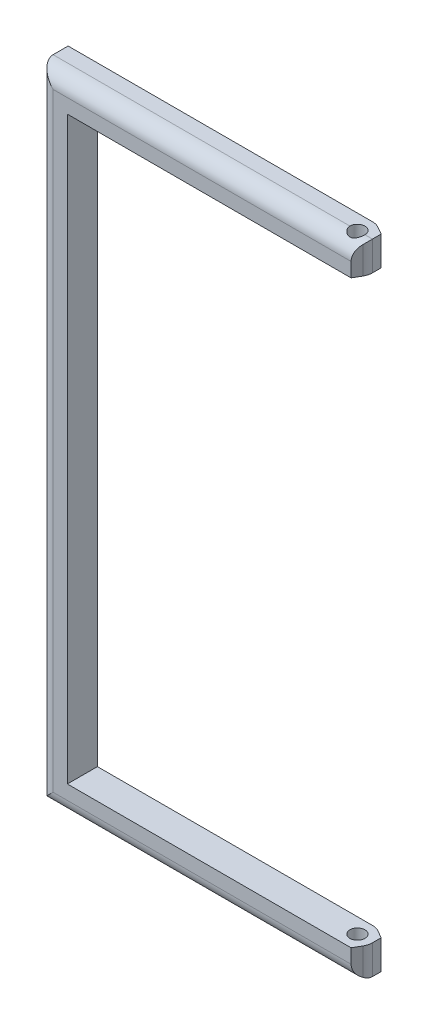
ISO-10303-21;
HEADER;
FILE_DESCRIPTION(('STEP AP214'),'2;1');
FILE_NAME('part.step','',(''),(''),'','','');
FILE_SCHEMA(('AUTOMOTIVE_DESIGN { 1 0 10303 214 1 1 1 1 }'));
ENDSEC;
DATA;
#1=APPLICATION_CONTEXT('core data for automotive mechanical design processes');
#2=APPLICATION_PROTOCOL_DEFINITION('international standard','automotive_design',2000,#1);
#3=PRODUCT_CONTEXT('',#1,'mechanical');
#4=PRODUCT('Part','Part','',(#3));
#5=PRODUCT_RELATED_PRODUCT_CATEGORY('part','',(#4));
#6=PRODUCT_DEFINITION_FORMATION('','',#4);
#7=PRODUCT_DEFINITION_CONTEXT('part definition',#1,'design');
#8=PRODUCT_DEFINITION('design','',#6,#7);
#9=PRODUCT_DEFINITION_SHAPE('','',#8);
#10=(LENGTH_UNIT() NAMED_UNIT(*) SI_UNIT(.MILLI.,.METRE.));
#11=(NAMED_UNIT(*) PLANE_ANGLE_UNIT() SI_UNIT($,.RADIAN.));
#12=(NAMED_UNIT(*) SI_UNIT($,.STERADIAN.) SOLID_ANGLE_UNIT());
#13=UNCERTAINTY_MEASURE_WITH_UNIT(LENGTH_MEASURE(1.E-05),#10,'distance_accuracy_value','');
#14=(GEOMETRIC_REPRESENTATION_CONTEXT(3) GLOBAL_UNCERTAINTY_ASSIGNED_CONTEXT((#13)) GLOBAL_UNIT_ASSIGNED_CONTEXT((#10,
#11,#12)) REPRESENTATION_CONTEXT('',''));
#15=CARTESIAN_POINT('',(0.,0.,0.));
#16=DIRECTION('',(0.,0.,1.));
#17=DIRECTION('',(1.,0.,0.));
#18=AXIS2_PLACEMENT_3D('',#15,#16,#17);
#19=CARTESIAN_POINT('',(136.299385308343,12.1580789864667,-4.));
#20=DIRECTION('',(1.,0.,0.));
#21=DIRECTION('',(0.,0.,-1.));
#22=AXIS2_PLACEMENT_3D('',#19,#20,#21);
#23=PLANE('',#22);
#24=DIRECTION('',(0.,1.,0.));
#25=VECTOR('',#24,1.);
#26=CARTESIAN_POINT('',(136.299385308343,-68.9419210135332,-3.1547005383791));
#27=LINE('',#26,#25);
#28=CARTESIAN_POINT('',(136.299385308343,12.1580789864667,-3.1547005383791));
#29=VERTEX_POINT('',#28);
#30=CARTESIAN_POINT('',(136.299385308343,16.0580789864667,-3.1547005383791));
#31=VERTEX_POINT('',#30);
#32=EDGE_CURVE('E179',#29,#31,#27,.T.);
#33=ORIENTED_EDGE('',*,*,#32,.T.);
#34=DIRECTION('',(0.,0.,1.));
#35=VECTOR('',#34,1.);
#36=CARTESIAN_POINT('',(136.299385308343,16.0580789864667,-4.));
#37=LINE('',#36,#35);
#38=CARTESIAN_POINT('',(136.299385308343,16.0580789864667,-2.));
#39=VERTEX_POINT('',#38);
#40=EDGE_CURVE('E317',#31,#39,#37,.T.);
#41=ORIENTED_EDGE('',*,*,#40,.T.);
#42=DIRECTION('',(0.,1.,0.));
#43=VECTOR('',#42,1.);
#44=CARTESIAN_POINT('',(136.299385308343,-68.9419210135332,-2.));
#45=LINE('',#44,#43);
#46=CARTESIAN_POINT('',(136.299385308343,12.1580789864667,-2.));
#47=VERTEX_POINT('',#46);
#48=EDGE_CURVE('E340',#47,#39,#45,.T.);
#49=ORIENTED_EDGE('',*,*,#48,.F.);
#50=DIRECTION('',(0.,0.,1.));
#51=VECTOR('',#50,1.);
#52=CARTESIAN_POINT('',(136.299385308343,12.1580789864667,-4.));
#53=LINE('',#52,#51);
#54=EDGE_CURVE('E320',#29,#47,#53,.T.);
#55=ORIENTED_EDGE('',*,*,#54,.F.);
#56=EDGE_LOOP('',(#33,#41,#49,#55));
#57=FACE_BOUND('',#56,.T.);
#58=ADVANCED_FACE('F34',(#57),#23,.T.);
#59=CARTESIAN_POINT('',(136.299385308343,-68.9419210135332,-4.));
#60=DIRECTION('',(1.,0.,0.));
#61=DIRECTION('',(0.,0.,-1.));
#62=AXIS2_PLACEMENT_3D('',#59,#60,#61);
#63=PLANE('',#62);
#64=CARTESIAN_POINT('',(136.299385308343,-68.9419210135332,-3.1547005383791));
#65=VERTEX_POINT('',#64);
#66=CARTESIAN_POINT('',(136.299385308343,-65.0419210135332,-3.1547005383791));
#67=VERTEX_POINT('',#66);
#68=EDGE_CURVE('E166',#65,#67,#27,.T.);
#69=ORIENTED_EDGE('',*,*,#68,.T.);
#70=DIRECTION('',(0.,0.,1.));
#71=VECTOR('',#70,1.);
#72=CARTESIAN_POINT('',(136.299385308343,-65.0419210135332,-4.));
#73=LINE('',#72,#71);
#74=CARTESIAN_POINT('',(136.299385308343,-65.0419210135332,-2.));
#75=VERTEX_POINT('',#74);
#76=EDGE_CURVE('E189',#67,#75,#73,.T.);
#77=ORIENTED_EDGE('',*,*,#76,.T.);
#78=CARTESIAN_POINT('',(136.299385308343,-68.9419210135332,-2.));
#79=VERTEX_POINT('',#78);
#80=EDGE_CURVE('E185',#79,#75,#45,.T.);
#81=ORIENTED_EDGE('',*,*,#80,.F.);
#82=DIRECTION('',(0.,0.,1.));
#83=VECTOR('',#82,1.);
#84=CARTESIAN_POINT('',(136.299385308343,-68.9419210135332,-4.));
#85=LINE('',#84,#83);
#86=EDGE_CURVE('E182',#65,#79,#85,.T.);
#87=ORIENTED_EDGE('',*,*,#86,.F.);
#88=EDGE_LOOP('',(#69,#77,#81,#87));
#89=FACE_BOUND('',#88,.T.);
#90=ADVANCED_FACE('F188',(#89),#63,.T.);
#91=CARTESIAN_POINT('',(93.7993853083432,-68.9419210135332,-4.));
#92=DIRECTION('',(0.,-1.,0.));
#93=DIRECTION('',(0.,0.,-1.));
#94=AXIS2_PLACEMENT_3D('',#91,#92,#93);
#95=PLANE('',#94);
#96=ORIENTED_EDGE('',*,*,#86,.T.);
#97=DIRECTION('',(1.,0.,0.));
#98=VECTOR('',#97,1.);
#99=CARTESIAN_POINT('',(93.7993853083432,-68.9419210135332,-2.));
#100=LINE('',#99,#98);
#101=CARTESIAN_POINT('',(135.299385308343,-68.9419210135332,-2.));
#102=VERTEX_POINT('',#101);
#103=EDGE_CURVE('E44',#79,#102,#100,.F.);
#104=ORIENTED_EDGE('',*,*,#103,.T.);
#105=CARTESIAN_POINT('',(134.299385308343,-68.9419210135332,-2.));
#106=DIRECTION('',(0.,-1.,0.));
#107=DIRECTION('',(0.,0.,-1.));
#108=AXIS2_PLACEMENT_3D('',#105,#106,#107);
#109=CIRCLE('',#108,0.999999999999883);
#110=CARTESIAN_POINT('',(133.299385308343,-68.9419210135332,-2.));
#111=VERTEX_POINT('',#110);
#112=EDGE_CURVE('E285',#111,#102,#109,.T.);
#113=ORIENTED_EDGE('',*,*,#112,.F.);
#114=DIRECTION('',(1.,0.,0.));
#115=VECTOR('',#114,1.);
#116=CARTESIAN_POINT('',(93.7993853083432,-68.9419210135332,-2.));
#117=LINE('',#116,#115);
#118=CARTESIAN_POINT('',(93.7993853083432,-68.9419210135332,-2.));
#119=VERTEX_POINT('',#118);
#120=EDGE_CURVE('E395',#111,#119,#117,.F.);
#121=ORIENTED_EDGE('',*,*,#120,.T.);
#122=DIRECTION('',(0.,0.,1.));
#123=VECTOR('',#122,1.);
#124=CARTESIAN_POINT('',(93.7993853083432,-68.9419210135332,-4.));
#125=LINE('',#124,#123);
#126=CARTESIAN_POINT('',(93.7993853083432,-68.9419210135332,-4.));
#127=VERTEX_POINT('',#126);
#128=EDGE_CURVE('E202',#127,#119,#125,.T.);
#129=ORIENTED_EDGE('',*,*,#128,.F.);
#130=DIRECTION('',(1.,0.,0.));
#131=VECTOR('',#130,1.);
#132=CARTESIAN_POINT('',(93.7993853083432,-68.9419210135332,-4.));
#133=LINE('',#132,#131);
#134=CARTESIAN_POINT('',(134.299385308343,-68.9419210135332,-4.));
#135=VERTEX_POINT('',#134);
#136=EDGE_CURVE('E294',#127,#135,#133,.T.);
#137=ORIENTED_EDGE('',*,*,#136,.T.);
#138=CARTESIAN_POINT('',(134.299385308343,-68.9419210135332,-2.));
#139=DIRECTION('',(0.,-1.,0.));
#140=DIRECTION('',(1.,0.,0.));
#141=AXIS2_PLACEMENT_3D('',#138,#139,#140);
#142=CIRCLE('',#141,1.99999999999994);
#143=CARTESIAN_POINT('',(135.299385308343,-68.9419210135332,-3.73205080756874));
#144=VERTEX_POINT('',#143);
#145=EDGE_CURVE('E184',#135,#144,#142,.T.);
#146=ORIENTED_EDGE('',*,*,#145,.T.);
#147=DIRECTION('',(0.86602540378444,0.,0.499999999999998));
#148=VECTOR('',#147,1.);
#149=CARTESIAN_POINT('',(135.299385308343,-68.9419210135332,-3.73205080756869));
#150=LINE('',#149,#148);
#151=EDGE_CURVE('E170',#144,#65,#150,.T.);
#152=ORIENTED_EDGE('',*,*,#151,.T.);
#153=EDGE_LOOP('',(#96,#104,#113,#121,#129,#137,#146,#152));
#154=FACE_BOUND('',#153,.T.);
#155=ADVANCED_FACE('F181',(#154),#95,.T.);
#156=CARTESIAN_POINT('',(93.7993853083432,16.0580789864667,-4.));
#157=DIRECTION('',(-1.,0.,0.));
#158=DIRECTION('',(0.,0.,1.));
#159=AXIS2_PLACEMENT_3D('',#156,#157,#158);
#160=PLANE('',#159);
#161=ORIENTED_EDGE('',*,*,#128,.T.);
#162=DIRECTION('',(0.,-1.,0.));
#163=VECTOR('',#162,1.);
#164=CARTESIAN_POINT('',(93.7993853083432,16.0580789864667,-2.));
#165=LINE('',#164,#163);
#166=CARTESIAN_POINT('',(93.7993853083432,16.0580789864667,-2.));
#167=VERTEX_POINT('',#166);
#168=EDGE_CURVE('E386',#119,#167,#165,.F.);
#169=ORIENTED_EDGE('',*,*,#168,.T.);
#170=DIRECTION('',(0.,0.,1.));
#171=VECTOR('',#170,1.);
#172=CARTESIAN_POINT('',(93.7993853083432,16.0580789864667,-4.));
#173=LINE('',#172,#171);
#174=CARTESIAN_POINT('',(93.7993853083432,16.0580789864667,-4.));
#175=VERTEX_POINT('',#174);
#176=EDGE_CURVE('E314',#175,#167,#173,.T.);
#177=ORIENTED_EDGE('',*,*,#176,.F.);
#178=DIRECTION('',(0.,-1.,0.));
#179=VECTOR('',#178,1.);
#180=CARTESIAN_POINT('',(93.7993853083432,16.0580789864667,-4.));
#181=LINE('',#180,#179);
#182=EDGE_CURVE('E190',#175,#127,#181,.T.);
#183=ORIENTED_EDGE('',*,*,#182,.T.);
#184=EDGE_LOOP('',(#161,#169,#177,#183));
#185=FACE_BOUND('',#184,.T.);
#186=ADVANCED_FACE('F407',(#185),#160,.T.);
#187=CARTESIAN_POINT('',(136.299385308343,16.0580789864667,-4.));
#188=DIRECTION('',(0.,1.,0.));
#189=DIRECTION('',(-1.,0.,0.));
#190=AXIS2_PLACEMENT_3D('',#187,#188,#189);
#191=PLANE('',#190);
#192=ORIENTED_EDGE('',*,*,#176,.T.);
#193=DIRECTION('',(-1.,0.,0.));
#194=VECTOR('',#193,1.);
#195=CARTESIAN_POINT('',(136.299385308343,16.0580789864667,-2.));
#196=LINE('',#195,#194);
#197=CARTESIAN_POINT('',(133.299385308343,16.0580789864667,-2.));
#198=VERTEX_POINT('',#197);
#199=EDGE_CURVE('E219',#167,#198,#196,.F.);
#200=ORIENTED_EDGE('',*,*,#199,.T.);
#201=CARTESIAN_POINT('',(134.299385308343,16.0580789864667,-2.));
#202=DIRECTION('',(0.,-1.,0.));
#203=DIRECTION('',(0.,0.,-1.));
#204=AXIS2_PLACEMENT_3D('',#201,#202,#203);
#205=CIRCLE('',#204,0.999999999999883);
#206=CARTESIAN_POINT('',(135.299385308343,16.0580789864667,-2.));
#207=VERTEX_POINT('',#206);
#208=EDGE_CURVE('E291',#198,#207,#205,.T.);
#209=ORIENTED_EDGE('',*,*,#208,.T.);
#210=DIRECTION('',(-1.,0.,0.));
#211=VECTOR('',#210,1.);
#212=CARTESIAN_POINT('',(136.299385308343,16.0580789864667,-2.));
#213=LINE('',#212,#211);
#214=EDGE_CURVE('E217',#207,#39,#213,.F.);
#215=ORIENTED_EDGE('',*,*,#214,.T.);
#216=ORIENTED_EDGE('',*,*,#40,.F.);
#217=DIRECTION('',(0.86602540378444,0.,0.499999999999998));
#218=VECTOR('',#217,1.);
#219=CARTESIAN_POINT('',(135.933359904559,16.0580789864667,-3.36602540378433));
#220=LINE('',#219,#218);
#221=CARTESIAN_POINT('',(135.299385308343,16.0580789864667,-3.73205080756876));
#222=VERTEX_POINT('',#221);
#223=EDGE_CURVE('E368',#222,#31,#220,.T.);
#224=ORIENTED_EDGE('',*,*,#223,.F.);
#225=CARTESIAN_POINT('',(134.299385308343,16.0580789864667,-2.));
#226=DIRECTION('',(0.,1.,0.));
#227=DIRECTION('',(-1.,0.,0.));
#228=AXIS2_PLACEMENT_3D('',#225,#226,#227);
#229=CIRCLE('',#228,1.99999999999994);
#230=CARTESIAN_POINT('',(134.299385308343,16.0580789864667,-3.99999999999998));
#231=VERTEX_POINT('',#230);
#232=EDGE_CURVE('E206',#231,#222,#229,.F.);
#233=ORIENTED_EDGE('',*,*,#232,.F.);
#234=DIRECTION('',(-1.,0.,0.));
#235=VECTOR('',#234,1.);
#236=CARTESIAN_POINT('',(136.299385308343,16.0580789864667,-4.));
#237=LINE('',#236,#235);
#238=EDGE_CURVE('E195',#231,#175,#237,.T.);
#239=ORIENTED_EDGE('',*,*,#238,.T.);
#240=EDGE_LOOP('',(#192,#200,#209,#215,#216,#224,#233,#239));
#241=FACE_BOUND('',#240,.T.);
#242=ADVANCED_FACE('F259',(#241),#191,.T.);
#243=CARTESIAN_POINT('',(97.6993853083432,12.1580789864667,-4.));
#244=DIRECTION('',(0.,-1.,0.));
#245=DIRECTION('',(1.,0.,0.));
#246=AXIS2_PLACEMENT_3D('',#243,#244,#245);
#247=PLANE('',#246);
#248=DIRECTION('',(-0.86602540378444,0.,-0.499999999999998));
#249=VECTOR('',#248,1.);
#250=CARTESIAN_POINT('',(106.983359904559,12.1580789864667,-20.080315696824));
#251=LINE('',#250,#249);
#252=CARTESIAN_POINT('',(135.299385308343,12.1580789864667,-3.73205080756874));
#253=VERTEX_POINT('',#252);
#254=EDGE_CURVE('E366',#29,#253,#251,.T.);
#255=ORIENTED_EDGE('',*,*,#254,.F.);
#256=ORIENTED_EDGE('',*,*,#54,.T.);
#257=CARTESIAN_POINT('',(134.299385308343,12.1580789864667,-2.));
#258=DIRECTION('',(0.,-1.,0.));
#259=DIRECTION('',(1.,0.,0.));
#260=AXIS2_PLACEMENT_3D('',#257,#258,#259);
#261=CIRCLE('',#260,2.0000000000002);
#262=CARTESIAN_POINT('',(136.031436115912,12.1580789864667,-0.999999999998681));
#263=VERTEX_POINT('',#262);
#264=EDGE_CURVE('E363',#263,#47,#261,.F.);
#265=ORIENTED_EDGE('',*,*,#264,.F.);
#266=DIRECTION('',(0.499999999999988,0.,-0.866025403784446));
#267=VECTOR('',#266,1.);
#268=CARTESIAN_POINT('',(127.747461519697,12.1580789864667,13.3482648892551));
#269=LINE('',#268,#267);
#270=CARTESIAN_POINT('',(135.454085846723,12.1580789864667,0.));
#271=VERTEX_POINT('',#270);
#272=EDGE_CURVE('E348',#271,#263,#269,.T.);
#273=ORIENTED_EDGE('',*,*,#272,.F.);
#274=DIRECTION('',(1.,0.,0.));
#275=VECTOR('',#274,1.);
#276=CARTESIAN_POINT('',(97.6993853083432,12.1580789864667,0.));
#277=LINE('',#276,#275);
#278=CARTESIAN_POINT('',(97.6993853083432,12.1580789864667,0.));
#279=VERTEX_POINT('',#278);
#280=EDGE_CURVE('E297',#279,#271,#277,.T.);
#281=ORIENTED_EDGE('',*,*,#280,.F.);
#282=DIRECTION('',(0.,0.,1.));
#283=VECTOR('',#282,1.);
#284=CARTESIAN_POINT('',(97.6993853083432,12.1580789864667,-4.));
#285=LINE('',#284,#283);
#286=CARTESIAN_POINT('',(97.6993853083432,12.1580789864667,-4.));
#287=VERTEX_POINT('',#286);
#288=EDGE_CURVE('E323',#287,#279,#285,.T.);
#289=ORIENTED_EDGE('',*,*,#288,.F.);
#290=DIRECTION('',(1.,0.,0.));
#291=VECTOR('',#290,1.);
#292=CARTESIAN_POINT('',(97.6993853083432,12.1580789864667,-4.));
#293=LINE('',#292,#291);
#294=CARTESIAN_POINT('',(134.299385308343,12.1580789864667,-4.));
#295=VERTEX_POINT('',#294);
#296=EDGE_CURVE('E302',#287,#295,#293,.T.);
#297=ORIENTED_EDGE('',*,*,#296,.T.);
#298=CARTESIAN_POINT('',(134.299385308343,12.1580789864667,-2.));
#299=DIRECTION('',(0.,-1.,0.));
#300=DIRECTION('',(1.,0.,0.));
#301=AXIS2_PLACEMENT_3D('',#298,#299,#300);
#302=CIRCLE('',#301,1.99999999999994);
#303=EDGE_CURVE('E210',#253,#295,#302,.F.);
#304=ORIENTED_EDGE('',*,*,#303,.F.);
#305=EDGE_LOOP('',(#255,#256,#265,#273,#281,#289,#297,#304));
#306=FACE_BOUND('',#305,.T.);
#307=CARTESIAN_POINT('',(134.299385308343,12.1580789864667,-2.));
#308=DIRECTION('',(0.,-1.,0.));
#309=DIRECTION('',(1.,0.,0.));
#310=AXIS2_PLACEMENT_3D('',#307,#308,#309);
#311=CIRCLE('',#310,0.999999999999883);
#312=CARTESIAN_POINT('',(135.299385308343,12.1580789864667,-2.));
#313=VERTEX_POINT('',#312);
#314=EDGE_CURVE('E286',#313,#313,#311,.T.);
#315=ORIENTED_EDGE('',*,*,#314,.F.);
#316=EDGE_LOOP('',(#315));
#317=FACE_BOUND('',#316,.T.);
#318=ADVANCED_FACE('F261',(#306,#317),#247,.T.);
#319=CARTESIAN_POINT('',(97.6993853083432,-65.0419210135332,-4.));
#320=DIRECTION('',(1.,0.,0.));
#321=DIRECTION('',(0.,1.,0.));
#322=AXIS2_PLACEMENT_3D('',#319,#320,#321);
#323=PLANE('',#322);
#324=DIRECTION('',(0.,1.,0.));
#325=VECTOR('',#324,1.);
#326=CARTESIAN_POINT('',(97.6993853083432,-65.0419210135332,0.));
#327=LINE('',#326,#325);
#328=CARTESIAN_POINT('',(97.6993853083432,-65.0419210135332,0.));
#329=VERTEX_POINT('',#328);
#330=EDGE_CURVE('E307',#329,#279,#327,.T.);
#331=ORIENTED_EDGE('',*,*,#330,.F.);
#332=DIRECTION('',(0.,0.,1.));
#333=VECTOR('',#332,1.);
#334=CARTESIAN_POINT('',(97.6993853083432,-65.0419210135332,-4.));
#335=LINE('',#334,#333);
#336=CARTESIAN_POINT('',(97.6993853083432,-65.0419210135332,-4.));
#337=VERTEX_POINT('',#336);
#338=EDGE_CURVE('E192',#337,#329,#335,.T.);
#339=ORIENTED_EDGE('',*,*,#338,.F.);
#340=DIRECTION('',(0.,1.,0.));
#341=VECTOR('',#340,1.);
#342=CARTESIAN_POINT('',(97.6993853083432,-65.0419210135332,-4.));
#343=LINE('',#342,#341);
#344=EDGE_CURVE('E299',#337,#287,#343,.T.);
#345=ORIENTED_EDGE('',*,*,#344,.T.);
#346=ORIENTED_EDGE('',*,*,#288,.T.);
#347=EDGE_LOOP('',(#331,#339,#345,#346));
#348=FACE_BOUND('',#347,.T.);
#349=ADVANCED_FACE('F264',(#348),#323,.T.);
#350=CARTESIAN_POINT('',(136.299385308343,-65.0419210135332,-4.));
#351=DIRECTION('',(0.,1.,0.));
#352=DIRECTION('',(-1.,0.,0.));
#353=AXIS2_PLACEMENT_3D('',#350,#351,#352);
#354=PLANE('',#353);
#355=DIRECTION('',(0.86602540378444,0.,0.499999999999998));
#356=VECTOR('',#355,1.);
#357=CARTESIAN_POINT('',(135.933359904559,-65.0419210135332,-3.36602540378434));
#358=LINE('',#357,#356);
#359=CARTESIAN_POINT('',(135.299385308343,-65.0419210135332,-3.73205080756874));
#360=VERTEX_POINT('',#359);
#361=EDGE_CURVE('E173',#360,#67,#358,.T.);
#362=ORIENTED_EDGE('',*,*,#361,.F.);
#363=CARTESIAN_POINT('',(134.299385308343,-65.0419210135332,-2.));
#364=DIRECTION('',(0.,1.,0.));
#365=DIRECTION('',(-1.,0.,0.));
#366=AXIS2_PLACEMENT_3D('',#363,#364,#365);
#367=CIRCLE('',#366,1.99999999999994);
#368=CARTESIAN_POINT('',(134.299385308343,-65.0419210135332,-4.));
#369=VERTEX_POINT('',#368);
#370=EDGE_CURVE('E351',#369,#360,#367,.F.);
#371=ORIENTED_EDGE('',*,*,#370,.F.);
#372=DIRECTION('',(-1.,0.,0.));
#373=VECTOR('',#372,1.);
#374=CARTESIAN_POINT('',(136.299385308343,-65.0419210135332,-4.));
#375=LINE('',#374,#373);
#376=EDGE_CURVE('E296',#369,#337,#375,.T.);
#377=ORIENTED_EDGE('',*,*,#376,.T.);
#378=ORIENTED_EDGE('',*,*,#338,.T.);
#379=DIRECTION('',(-1.,0.,0.));
#380=VECTOR('',#379,1.);
#381=CARTESIAN_POINT('',(136.299385308343,-65.0419210135332,0.));
#382=LINE('',#381,#380);
#383=CARTESIAN_POINT('',(135.454085846723,-65.0419210135332,0.));
#384=VERTEX_POINT('',#383);
#385=EDGE_CURVE('E288',#384,#329,#382,.T.);
#386=ORIENTED_EDGE('',*,*,#385,.F.);
#387=DIRECTION('',(-0.499999999999988,0.,0.866025403784446));
#388=VECTOR('',#387,1.);
#389=CARTESIAN_POINT('',(137.397461519697,-65.0419210135332,-3.36602540378428));
#390=LINE('',#389,#388);
#391=CARTESIAN_POINT('',(136.031436115912,-65.0419210135332,-0.999999999998673));
#392=VERTEX_POINT('',#391);
#393=EDGE_CURVE('E343',#392,#384,#390,.T.);
#394=ORIENTED_EDGE('',*,*,#393,.F.);
#395=CARTESIAN_POINT('',(134.299385308343,-65.0419210135332,-2.));
#396=DIRECTION('',(0.,1.,0.));
#397=DIRECTION('',(-1.,0.,0.));
#398=AXIS2_PLACEMENT_3D('',#395,#396,#397);
#399=CIRCLE('',#398,2.0000000000002);
#400=EDGE_CURVE('E209',#75,#392,#399,.F.);
#401=ORIENTED_EDGE('',*,*,#400,.F.);
#402=ORIENTED_EDGE('',*,*,#76,.F.);
#403=EDGE_LOOP('',(#362,#371,#377,#378,#386,#394,#401,#402));
#404=FACE_BOUND('',#403,.T.);
#405=CARTESIAN_POINT('',(134.299385308343,-65.0419210135332,-2.));
#406=DIRECTION('',(0.,1.,0.));
#407=DIRECTION('',(-1.,0.,0.));
#408=AXIS2_PLACEMENT_3D('',#405,#406,#407);
#409=CIRCLE('',#408,0.999999999999883);
#410=CARTESIAN_POINT('',(133.299385308343,-65.0419210135332,-2.));
#411=VERTEX_POINT('',#410);
#412=EDGE_CURVE('E283',#411,#411,#409,.F.);
#413=ORIENTED_EDGE('',*,*,#412,.T.);
#414=EDGE_LOOP('',(#413));
#415=FACE_BOUND('',#414,.T.);
#416=ADVANCED_FACE('F268',(#404,#415),#354,.T.);
#417=CARTESIAN_POINT('',(0.,0.,-4.));
#418=DIRECTION('',(0.,0.,1.));
#419=DIRECTION('',(1.,0.,0.));
#420=AXIS2_PLACEMENT_3D('',#417,#418,#419);
#421=PLANE('',#420);
#422=ORIENTED_EDGE('',*,*,#238,.F.);
#423=DIRECTION('',(0.,1.,0.));
#424=VECTOR('',#423,1.);
#425=CARTESIAN_POINT('',(134.299385308343,-68.9419210135332,-3.99999999999997));
#426=LINE('',#425,#424);
#427=EDGE_CURVE('E201',#231,#295,#426,.F.);
#428=ORIENTED_EDGE('',*,*,#427,.T.);
#429=ORIENTED_EDGE('',*,*,#296,.F.);
#430=ORIENTED_EDGE('',*,*,#344,.F.);
#431=ORIENTED_EDGE('',*,*,#376,.F.);
#432=DIRECTION('',(0.,1.,0.));
#433=VECTOR('',#432,1.);
#434=CARTESIAN_POINT('',(134.299385308343,-68.9419210135332,-4.));
#435=LINE('',#434,#433);
#436=EDGE_CURVE('E178',#135,#369,#435,.T.);
#437=ORIENTED_EDGE('',*,*,#436,.F.);
#438=ORIENTED_EDGE('',*,*,#136,.F.);
#439=ORIENTED_EDGE('',*,*,#182,.F.);
#440=EDGE_LOOP('',(#422,#428,#429,#430,#431,#437,#438,#439));
#441=FACE_BOUND('',#440,.T.);
#442=ADVANCED_FACE('F271',(#441),#421,.F.);
#443=CARTESIAN_POINT('',(0.,0.,0.));
#444=DIRECTION('',(0.,0.,1.));
#445=DIRECTION('',(1.,0.,0.));
#446=AXIS2_PLACEMENT_3D('',#443,#444,#445);
#447=PLANE('',#446);
#448=DIRECTION('',(0.,-1.,0.));
#449=VECTOR('',#448,1.);
#450=CARTESIAN_POINT('',(135.454085846723,0.,0.));
#451=LINE('',#450,#449);
#452=CARTESIAN_POINT('',(135.454085846723,14.0580789864667,0.));
#453=VERTEX_POINT('',#452);
#454=EDGE_CURVE('E199',#453,#271,#451,.T.);
#455=ORIENTED_EDGE('',*,*,#454,.F.);
#456=DIRECTION('',(-1.,0.,0.));
#457=VECTOR('',#456,1.);
#458=CARTESIAN_POINT('',(0.,14.0580789864667,0.));
#459=LINE('',#458,#457);
#460=CARTESIAN_POINT('',(95.7993853083432,14.0580789864667,0.));
#461=VERTEX_POINT('',#460);
#462=EDGE_CURVE('E214',#453,#461,#459,.T.);
#463=ORIENTED_EDGE('',*,*,#462,.T.);
#464=DIRECTION('',(0.,-1.,0.));
#465=VECTOR('',#464,1.);
#466=CARTESIAN_POINT('',(95.7993853083432,0.,0.));
#467=LINE('',#466,#465);
#468=CARTESIAN_POINT('',(95.7993853083432,-66.9419210135332,0.));
#469=VERTEX_POINT('',#468);
#470=EDGE_CURVE('E212',#461,#469,#467,.T.);
#471=ORIENTED_EDGE('',*,*,#470,.T.);
#472=DIRECTION('',(1.,0.,0.));
#473=VECTOR('',#472,1.);
#474=CARTESIAN_POINT('',(0.,-66.9419210135332,0.));
#475=LINE('',#474,#473);
#476=CARTESIAN_POINT('',(135.454085846723,-66.9419210135332,0.));
#477=VERTEX_POINT('',#476);
#478=EDGE_CURVE('E205',#469,#477,#475,.T.);
#479=ORIENTED_EDGE('',*,*,#478,.T.);
#480=DIRECTION('',(0.,1.,0.));
#481=VECTOR('',#480,1.);
#482=CARTESIAN_POINT('',(135.454085846723,-68.9419210135332,0.));
#483=LINE('',#482,#481);
#484=EDGE_CURVE('E335',#477,#384,#483,.T.);
#485=ORIENTED_EDGE('',*,*,#484,.T.);
#486=ORIENTED_EDGE('',*,*,#385,.T.);
#487=ORIENTED_EDGE('',*,*,#330,.T.);
#488=ORIENTED_EDGE('',*,*,#280,.T.);
#489=EDGE_LOOP('',(#455,#463,#471,#479,#485,#486,#487,#488));
#490=FACE_BOUND('',#489,.T.);
#491=ADVANCED_FACE('F276',(#490),#447,.T.);
#492=CARTESIAN_POINT('',(134.299385308343,16.0590789864667,-2.));
#493=DIRECTION('',(0.,-1.,0.));
#494=DIRECTION('',(0.,0.,-1.));
#495=AXIS2_PLACEMENT_3D('',#492,#493,#494);
#496=CYLINDRICAL_SURFACE('',#495,0.999999999999883);
#497=ORIENTED_EDGE('',*,*,#412,.F.);
#498=EDGE_LOOP('',(#497));
#499=FACE_BOUND('',#498,.T.);
#500=ORIENTED_EDGE('',*,*,#112,.T.);
#501=CARTESIAN_POINT('',(135.299385308343,-68.9419210135332,-2.));
#502=CARTESIAN_POINT('',(135.299386711074,-68.9419237130004,-1.97359480770342));
#503=CARTESIAN_POINT('',(135.29833874008,-68.9413975107012,-1.94720365209219));
#504=CARTESIAN_POINT('',(135.294168474038,-68.939316495953,-1.89463699739136));
#505=CARTESIAN_POINT('',(135.291047012006,-68.9377620965785,-1.86846141596944));
#506=CARTESIAN_POINT('',(135.278652391962,-68.9316218377139,-1.79078725269119));
#507=CARTESIAN_POINT('',(135.266348379456,-68.9255582646796,-1.73985309513113));
#508=CARTESIAN_POINT('',(135.234200080682,-68.9100882819551,-1.64108226923488));
#509=CARTESIAN_POINT('',(135.214364418171,-68.9006856962367,-1.59324213128518));
#510=CARTESIAN_POINT('',(135.16784363353,-68.8793915768469,-1.50157781963612));
#511=CARTESIAN_POINT('',(135.141151666126,-68.8674975579538,-1.45775771918991));
#512=CARTESIAN_POINT('',(135.07986638751,-68.8414829152604,-1.37248899807208));
#513=CARTESIAN_POINT('',(135.044895180974,-68.8272715296671,-1.33134026556736));
#514=CARTESIAN_POINT('',(134.968859568114,-68.7985192011646,-1.25521716110837));
#515=CARTESIAN_POINT('',(134.927791189203,-68.7839780486701,-1.22024684745402));
#516=CARTESIAN_POINT('',(134.836901397632,-68.7549103479938,-1.15474752559896));
#517=CARTESIAN_POINT('',(134.786648009004,-68.7404725389094,-1.12477393006021));
#518=CARTESIAN_POINT('',(134.68101664868,-68.7147805310697,-1.07383128960193));
#519=CARTESIAN_POINT('',(134.625642495893,-68.7035239848358,-1.0528555991084));
#520=CARTESIAN_POINT('',(134.514720814657,-68.6864997776397,-1.02186772392922));
#521=CARTESIAN_POINT('',(134.459382116603,-68.6804438657546,-1.01127438157821));
#522=CARTESIAN_POINT('',(134.347407759938,-68.6737399295584,-0.999573034766601));
#523=CARTESIAN_POINT('',(134.290773406739,-68.6730866833896,-0.998455871234702));
#524=CARTESIAN_POINT('',(134.185098747184,-68.6770303358935,-1.00531274670431));
#525=CARTESIAN_POINT('',(134.135960211481,-68.6810087368607,-1.01221558871981));
#526=CARTESIAN_POINT('',(134.039662375127,-68.6926834674745,-1.03306045501754));
#527=CARTESIAN_POINT('',(133.992503666671,-68.7003809010483,-1.04700456942881));
#528=CARTESIAN_POINT('',(133.90015682294,-68.7187956483884,-1.08178996933763));
#529=CARTESIAN_POINT('',(133.855040161836,-68.7295791195734,-1.10278432558056));
#530=CARTESIAN_POINT('',(133.768752149966,-68.7529547103336,-1.15095758715459));
#531=CARTESIAN_POINT('',(133.727582693196,-68.765547691,-1.17813944054774));
#532=CARTESIAN_POINT('',(133.644865423385,-68.7930521346952,-1.24193279360448));
#533=CARTESIAN_POINT('',(133.603931031134,-68.8080551549154,-1.27930280082904));
#534=CARTESIAN_POINT('',(133.528651944631,-68.8373963954604,-1.36044214863203));
#535=CARTESIAN_POINT('',(133.49431080831,-68.8517342536958,-1.40421492202558));
#536=CARTESIAN_POINT('',(133.431683697667,-68.8789477947496,-1.49950647395908));
#537=CARTESIAN_POINT('',(133.403757573167,-68.8917232653066,-1.55129238481473));
#538=CARTESIAN_POINT('',(133.357268238603,-68.9135095832109,-1.65959794354017));
#539=CARTESIAN_POINT('',(133.338688195745,-68.9225271936025,-1.71610886569382));
#540=CARTESIAN_POINT('',(133.316697933443,-68.9333073389701,-1.81089839311792));
#541=CARTESIAN_POINT('',(133.310227827957,-68.9365158617895,-1.84832815530934));
#542=CARTESIAN_POINT('',(133.30156342715,-68.9408317681887,-1.92382753920582));
#543=CARTESIAN_POINT('',(133.299372604759,-68.9419374451474,-1.96189765535248));
#544=CARTESIAN_POINT('',(133.299385308343,-68.9419210135332,-2.));
#545=B_SPLINE_CURVE_WITH_KNOTS('',3,(#501,#502,#503,#504,#505,#506,#507,#508,#509,#510,#511,
#512,#513,#514,#515,#516,#517,#518,#519,#520,#521,#522,#523,#524,#525,#526,#527,#528,#529,#530,
#531,#532,#533,#534,#535,#536,#537,#538,#539,#540,#541,#542,#543,#544),.UNSPECIFIED.,.F.,.F.,(4,
2,2,2,2,2,2,2,2,2,2,2,2,2,2,2,2,2,2,2,2,4),(0.,0.0791624071485387,0.158293030372229,
0.315701742302581,0.472930761738308,0.630317371504147,0.797144021853014,0.964079848299516,
1.14397301600183,1.32373309046473,1.49273181845549,1.66156718439742,1.81021234232031,
1.95890164998477,2.11105391388249,2.26327882374082,2.43479774097312,2.60640895669881,
2.78607476153223,2.96541580950633,3.07949288402975,3.19366250143052),.UNSPECIFIED.);
#546=EDGE_CURVE('E11',#102,#111,#545,.T.);
#547=ORIENTED_EDGE('',*,*,#546,.T.);
#548=EDGE_LOOP('',(#500,#547));
#549=FACE_BOUND('',#548,.T.);
#550=ADVANCED_FACE('F402',(#499,#549),#496,.F.);
#551=CARTESIAN_POINT('',(134.299385308343,-68.9429210135332,-2.));
#552=DIRECTION('',(0.,1.,0.));
#553=DIRECTION('',(-1.,0.,0.));
#554=AXIS2_PLACEMENT_3D('',#551,#552,#553);
#555=CYLINDRICAL_SURFACE('',#554,0.999999999999883);
#556=ORIENTED_EDGE('',*,*,#314,.T.);
#557=EDGE_LOOP('',(#556));
#558=FACE_BOUND('',#557,.T.);
#559=ORIENTED_EDGE('',*,*,#208,.F.);
#560=CARTESIAN_POINT('',(133.299385308343,16.0580789864667,-2.));
#561=CARTESIAN_POINT('',(133.299383905613,16.0580816859339,-1.97359480770342));
#562=CARTESIAN_POINT('',(133.300431876606,16.0575554836347,-1.94720365209219));
#563=CARTESIAN_POINT('',(133.304602142648,16.0554744688864,-1.89463699739135));
#564=CARTESIAN_POINT('',(133.307723604681,16.053920069512,-1.86846141596944));
#565=CARTESIAN_POINT('',(133.320118224724,16.0477798106473,-1.79078725269119));
#566=CARTESIAN_POINT('',(133.33242223723,16.0417162376131,-1.73985309513113));
#567=CARTESIAN_POINT('',(133.364570536004,16.0262462548886,-1.64108226923488));
#568=CARTESIAN_POINT('',(133.384406198515,16.0168436691702,-1.59324213128517));
#569=CARTESIAN_POINT('',(133.430926983157,15.9955495497804,-1.50157781963609));
#570=CARTESIAN_POINT('',(133.45761895056,15.9836555308872,-1.45775771918989));
#571=CARTESIAN_POINT('',(133.518904229177,15.9576408881939,-1.37248899807206));
#572=CARTESIAN_POINT('',(133.553875435712,15.9434295026006,-1.33134026556735));
#573=CARTESIAN_POINT('',(133.629911048572,15.914677174098,-1.25521716110836));
#574=CARTESIAN_POINT('',(133.670979427483,15.9001360216035,-1.220246847454));
#575=CARTESIAN_POINT('',(133.761869219055,15.8710683209273,-1.15474752559895));
#576=CARTESIAN_POINT('',(133.812122607682,15.8566305118429,-1.12477393006021));
#577=CARTESIAN_POINT('',(133.917753968006,15.8309385040031,-1.07383128960193));
#578=CARTESIAN_POINT('',(133.973128120793,15.8196819577693,-1.05285559910839));
#579=CARTESIAN_POINT('',(134.08404980203,15.8026577505732,-1.02186772392922));
#580=CARTESIAN_POINT('',(134.139388500083,15.7966018386881,-1.0112743815782));
#581=CARTESIAN_POINT('',(134.251362856748,15.7898979024918,-0.999573034766601));
#582=CARTESIAN_POINT('',(134.307997209948,15.7892446563231,-0.998455871234702));
#583=CARTESIAN_POINT('',(134.413671869502,15.793188308827,-1.00531274670431));
#584=CARTESIAN_POINT('',(134.462810405205,15.7971667097941,-1.01221558871981));
#585=CARTESIAN_POINT('',(134.55910824156,15.808841440408,-1.03306045501754));
#586=CARTESIAN_POINT('',(134.606266950015,15.8165388739818,-1.04700456942882));
#587=CARTESIAN_POINT('',(134.698613793746,15.8349536213219,-1.08178996933763));
#588=CARTESIAN_POINT('',(134.74373045485,15.8457370925069,-1.10278432558056));
#589=CARTESIAN_POINT('',(134.83001846672,15.869112683267,-1.15095758715459));
#590=CARTESIAN_POINT('',(134.87118792349,15.8817056639334,-1.17813944054775));
#591=CARTESIAN_POINT('',(134.953905193301,15.9092101076287,-1.2419327936045));
#592=CARTESIAN_POINT('',(134.994839585553,15.9242131278489,-1.27930280082905));
#593=CARTESIAN_POINT('',(135.070118672055,15.9535543683939,-1.36044214863203));
#594=CARTESIAN_POINT('',(135.104459808376,15.9678922266292,-1.40421492202558));
#595=CARTESIAN_POINT('',(135.167086919019,15.9951057676831,-1.49950647395908));
#596=CARTESIAN_POINT('',(135.195013043519,16.00788123824,-1.55129238481474));
#597=CARTESIAN_POINT('',(135.241502378083,16.0296675561444,-1.65959794354019));
#598=CARTESIAN_POINT('',(135.260082420942,16.038685166536,-1.71610886569384));
#599=CARTESIAN_POINT('',(135.282072683243,16.0494653119036,-1.81089839311795));
#600=CARTESIAN_POINT('',(135.28854278873,16.052673834723,-1.84832815530937));
#601=CARTESIAN_POINT('',(135.297207189536,16.0569897411222,-1.92382753920584));
#602=CARTESIAN_POINT('',(135.299398011927,16.0580954180809,-1.96189765535249));
#603=CARTESIAN_POINT('',(135.299385308343,16.0580789864667,-2.00000000000001));
#604=B_SPLINE_CURVE_WITH_KNOTS('',3,(#560,#561,#562,#563,#564,#565,#566,#567,#568,#569,#570,
#571,#572,#573,#574,#575,#576,#577,#578,#579,#580,#581,#582,#583,#584,#585,#586,#587,#588,#589,
#590,#591,#592,#593,#594,#595,#596,#597,#598,#599,#600,#601,#602,#603),.UNSPECIFIED.,.F.,.F.,(4,
2,2,2,2,2,2,2,2,2,2,2,2,2,2,2,2,2,2,2,2,4),(0.,0.0791624071485423,0.15829303037223,
0.31570174230259,0.472930761738319,0.630317371504162,0.797144021853048,0.964079848299526,
1.14397301600183,1.32373309046476,1.49273181845552,1.66156718439742,1.81021234232033,
1.9589016499848,2.11105391388249,2.26327882374086,2.43479774097313,2.60640895669881,
2.78607476153225,2.96541580950636,3.07949288402977,3.19366250143053),.UNSPECIFIED.);
#605=EDGE_CURVE('E221',#198,#207,#604,.T.);
#606=ORIENTED_EDGE('',*,*,#605,.T.);
#607=EDGE_LOOP('',(#559,#606));
#608=FACE_BOUND('',#607,.T.);
#609=ADVANCED_FACE('F231',(#558,#608),#555,.F.);
#610=CARTESIAN_POINT('',(135.454085846723,-68.9419210135332,0.));
#611=DIRECTION('',(-0.866025403784446,0.,-0.499999999999988));
#612=DIRECTION('',(-0.499999999999988,0.,0.866025403784446));
#613=AXIS2_PLACEMENT_3D('',#610,#611,#612);
#614=PLANE('',#613);
#615=ORIENTED_EDGE('',*,*,#484,.F.);
#616=CARTESIAN_POINT('',(136.608786385102,-66.9419210135332,-2.));
#617=DIRECTION('',(-0.866025403784446,0.,-0.499999999999988));
#618=DIRECTION('',(0.499999999999988,0.,-0.866025403784446));
#619=AXIS2_PLACEMENT_3D('',#616,#617,#618);
#620=ELLIPSE('',#619,2.30940107675848,2.);
#621=CARTESIAN_POINT('',(136.031436115912,-68.6739718211018,-0.999999999998677));
#622=VERTEX_POINT('',#621);
#623=EDGE_CURVE('E388',#477,#622,#620,.F.);
#624=ORIENTED_EDGE('',*,*,#623,.T.);
#625=DIRECTION('',(0.,1.,0.));
#626=VECTOR('',#625,1.);
#627=CARTESIAN_POINT('',(136.031436115912,-68.9419210135332,-0.999999999998677));
#628=LINE('',#627,#626);
#629=EDGE_CURVE('E341',#622,#392,#628,.T.);
#630=ORIENTED_EDGE('',*,*,#629,.T.);
#631=ORIENTED_EDGE('',*,*,#393,.T.);
#632=EDGE_LOOP('',(#615,#624,#630,#631));
#633=FACE_BOUND('',#632,.T.);
#634=ADVANCED_FACE('F344',(#633),#614,.F.);
#635=CARTESIAN_POINT('',(134.299385308343,-68.9419210135332,-2.));
#636=DIRECTION('',(0.,1.,0.));
#637=DIRECTION('',(-1.,0.,0.));
#638=AXIS2_PLACEMENT_3D('',#635,#636,#637);
#639=CYLINDRICAL_SURFACE('',#638,2.0000000000002);
#640=ORIENTED_EDGE('',*,*,#629,.F.);
#641=CARTESIAN_POINT('',(134.299385308343,-66.9419210135332,-2.));
#642=DIRECTION('',(0.707106781186547,0.707106781186547,0.));
#643=DIRECTION('',(0.707106781186548,-0.707106781186547,0.));
#644=AXIS2_PLACEMENT_3D('',#641,#642,#643);
#645=ELLIPSE('',#644,2.82842712474634,2.0000000000001);
#646=EDGE_CURVE('E393',#622,#79,#645,.T.);
#647=ORIENTED_EDGE('',*,*,#646,.T.);
#648=ORIENTED_EDGE('',*,*,#80,.T.);
#649=ORIENTED_EDGE('',*,*,#400,.T.);
#650=EDGE_LOOP('',(#640,#647,#648,#649));
#651=FACE_BOUND('',#650,.T.);
#652=ADVANCED_FACE('F465',(#651),#639,.T.);
#653=ORIENTED_EDGE('',*,*,#48,.T.);
#654=CARTESIAN_POINT('',(134.299385308343,14.0580789864667,-2.));
#655=DIRECTION('',(-0.707106781186548,0.707106781186547,0.));
#656=DIRECTION('',(-0.707106781186547,-0.707106781186548,0.));
#657=AXIS2_PLACEMENT_3D('',#654,#655,#656);
#658=ELLIPSE('',#657,2.82842712474634,2.0000000000001);
#659=CARTESIAN_POINT('',(136.031436115912,15.7901297940347,-0.999999999998677));
#660=VERTEX_POINT('',#659);
#661=EDGE_CURVE('E229',#39,#660,#658,.F.);
#662=ORIENTED_EDGE('',*,*,#661,.T.);
#663=EDGE_CURVE('E356',#263,#660,#628,.T.);
#664=ORIENTED_EDGE('',*,*,#663,.F.);
#665=ORIENTED_EDGE('',*,*,#264,.T.);
#666=EDGE_LOOP('',(#653,#662,#664,#665));
#667=FACE_BOUND('',#666,.T.);
#668=ADVANCED_FACE('F429',(#667),#639,.T.);
#669=ORIENTED_EDGE('',*,*,#663,.T.);
#670=CARTESIAN_POINT('',(136.608786385102,14.0580789864667,-2.));
#671=DIRECTION('',(-0.866025403784446,0.,-0.499999999999988));
#672=DIRECTION('',(-0.499999999999988,0.,0.866025403784446));
#673=AXIS2_PLACEMENT_3D('',#670,#671,#672);
#674=ELLIPSE('',#673,2.30940107675848,2.);
#675=EDGE_CURVE('E382',#660,#453,#674,.F.);
#676=ORIENTED_EDGE('',*,*,#675,.T.);
#677=ORIENTED_EDGE('',*,*,#454,.T.);
#678=ORIENTED_EDGE('',*,*,#272,.T.);
#679=EDGE_LOOP('',(#669,#676,#677,#678));
#680=FACE_BOUND('',#679,.T.);
#681=ADVANCED_FACE('F423',(#680),#614,.F.);
#682=CARTESIAN_POINT('',(134.299385308343,-68.9419210135332,-2.));
#683=DIRECTION('',(0.,1.,0.));
#684=DIRECTION('',(-1.,0.,0.));
#685=AXIS2_PLACEMENT_3D('',#682,#683,#684);
#686=CYLINDRICAL_SURFACE('',#685,1.99999999999994);
#687=ORIENTED_EDGE('',*,*,#370,.T.);
#688=DIRECTION('',(0.,1.,0.));
#689=VECTOR('',#688,1.);
#690=CARTESIAN_POINT('',(135.299385308343,-68.9419210135332,-3.73205080756874));
#691=LINE('',#690,#689);
#692=EDGE_CURVE('E349',#144,#360,#691,.T.);
#693=ORIENTED_EDGE('',*,*,#692,.F.);
#694=ORIENTED_EDGE('',*,*,#145,.F.);
#695=ORIENTED_EDGE('',*,*,#436,.T.);
#696=EDGE_LOOP('',(#687,#693,#694,#695));
#697=FACE_BOUND('',#696,.T.);
#698=ADVANCED_FACE('F449',(#697),#686,.T.);
#699=CARTESIAN_POINT('',(135.299385308343,-68.9419210135332,-3.73205080756869));
#700=DIRECTION('',(-0.499999999999998,0.,0.86602540378444));
#701=DIRECTION('',(0.86602540378444,0.,0.499999999999998));
#702=AXIS2_PLACEMENT_3D('',#699,#700,#701);
#703=PLANE('',#702);
#704=ORIENTED_EDGE('',*,*,#361,.T.);
#705=ORIENTED_EDGE('',*,*,#68,.F.);
#706=ORIENTED_EDGE('',*,*,#151,.F.);
#707=ORIENTED_EDGE('',*,*,#692,.T.);
#708=EDGE_LOOP('',(#704,#705,#706,#707));
#709=FACE_BOUND('',#708,.T.);
#710=ADVANCED_FACE('F168',(#709),#703,.F.);
#711=ORIENTED_EDGE('',*,*,#223,.T.);
#712=ORIENTED_EDGE('',*,*,#32,.F.);
#713=ORIENTED_EDGE('',*,*,#254,.T.);
#714=EDGE_CURVE('E353',#253,#222,#691,.T.);
#715=ORIENTED_EDGE('',*,*,#714,.T.);
#716=EDGE_LOOP('',(#711,#712,#713,#715));
#717=FACE_BOUND('',#716,.T.);
#718=ADVANCED_FACE('F442',(#717),#703,.F.);
#719=ORIENTED_EDGE('',*,*,#232,.T.);
#720=ORIENTED_EDGE('',*,*,#714,.F.);
#721=ORIENTED_EDGE('',*,*,#303,.T.);
#722=ORIENTED_EDGE('',*,*,#427,.F.);
#723=EDGE_LOOP('',(#719,#720,#721,#722));
#724=FACE_BOUND('',#723,.T.);
#725=ADVANCED_FACE('F247',(#724),#686,.T.);
#726=CARTESIAN_POINT('',(0.,-66.9419210135332,-2.));
#727=DIRECTION('',(1.,0.,0.));
#728=DIRECTION('',(0.,0.,-1.));
#729=AXIS2_PLACEMENT_3D('',#726,#727,#728);
#730=CYLINDRICAL_SURFACE('',#729,2.);
#731=ORIENTED_EDGE('',*,*,#623,.F.);
#732=ORIENTED_EDGE('',*,*,#478,.F.);
#733=CARTESIAN_POINT('',(95.7993853083432,-66.9419210135332,-2.));
#734=DIRECTION('',(0.707106781186547,-0.707106781186547,0.));
#735=DIRECTION('',(0.707106781186547,0.707106781186547,0.));
#736=AXIS2_PLACEMENT_3D('',#733,#734,#735);
#737=ELLIPSE('',#736,2.82842712474619,2.);
#738=EDGE_CURVE('E39',#119,#469,#737,.F.);
#739=ORIENTED_EDGE('',*,*,#738,.F.);
#740=ORIENTED_EDGE('',*,*,#120,.F.);
#741=ORIENTED_EDGE('',*,*,#546,.F.);
#742=ORIENTED_EDGE('',*,*,#103,.F.);
#743=ORIENTED_EDGE('',*,*,#646,.F.);
#744=EDGE_LOOP('',(#731,#732,#739,#740,#741,#742,#743));
#745=FACE_BOUND('',#744,.T.);
#746=ADVANCED_FACE('F36',(#745),#730,.T.);
#747=CARTESIAN_POINT('',(95.7993853083432,0.,-2.));
#748=DIRECTION('',(0.,-1.,0.));
#749=DIRECTION('',(0.,0.,-1.));
#750=AXIS2_PLACEMENT_3D('',#747,#748,#749);
#751=CYLINDRICAL_SURFACE('',#750,2.);
#752=ORIENTED_EDGE('',*,*,#738,.T.);
#753=ORIENTED_EDGE('',*,*,#470,.F.);
#754=CARTESIAN_POINT('',(95.7993853083432,14.0580789864667,-2.));
#755=DIRECTION('',(-0.707106781186547,-0.707106781186548,0.));
#756=DIRECTION('',(0.707106781186548,-0.707106781186547,0.));
#757=AXIS2_PLACEMENT_3D('',#754,#755,#756);
#758=ELLIPSE('',#757,2.82842712474619,2.);
#759=EDGE_CURVE('E401',#167,#461,#758,.F.);
#760=ORIENTED_EDGE('',*,*,#759,.F.);
#761=ORIENTED_EDGE('',*,*,#168,.F.);
#762=EDGE_LOOP('',(#752,#753,#760,#761));
#763=FACE_BOUND('',#762,.T.);
#764=ADVANCED_FACE('F239',(#763),#751,.T.);
#765=CARTESIAN_POINT('',(0.,14.0580789864667,-2.));
#766=DIRECTION('',(-1.,0.,0.));
#767=DIRECTION('',(0.,-1.,0.));
#768=AXIS2_PLACEMENT_3D('',#765,#766,#767);
#769=CYLINDRICAL_SURFACE('',#768,2.);
#770=ORIENTED_EDGE('',*,*,#605,.F.);
#771=ORIENTED_EDGE('',*,*,#199,.F.);
#772=ORIENTED_EDGE('',*,*,#759,.T.);
#773=ORIENTED_EDGE('',*,*,#462,.F.);
#774=ORIENTED_EDGE('',*,*,#675,.F.);
#775=ORIENTED_EDGE('',*,*,#661,.F.);
#776=ORIENTED_EDGE('',*,*,#214,.F.);
#777=EDGE_LOOP('',(#770,#771,#772,#773,#774,#775,#776));
#778=FACE_BOUND('',#777,.T.);
#779=ADVANCED_FACE('F235',(#778),#769,.T.);
#780=CLOSED_SHELL('',(#58,#90,#155,#186,#242,#318,#349,#416,#442,#491,#550,#609,#634,#652,#668,
#681,#698,#710,#718,#725,#746,#764,#779));
#781=MANIFOLD_SOLID_BREP('B2',#780);
#782=ADVANCED_BREP_SHAPE_REPRESENTATION('',(#18,#781),#14);
#783=SHAPE_DEFINITION_REPRESENTATION(#9,#782);
ENDSEC;
END-ISO-10303-21;
